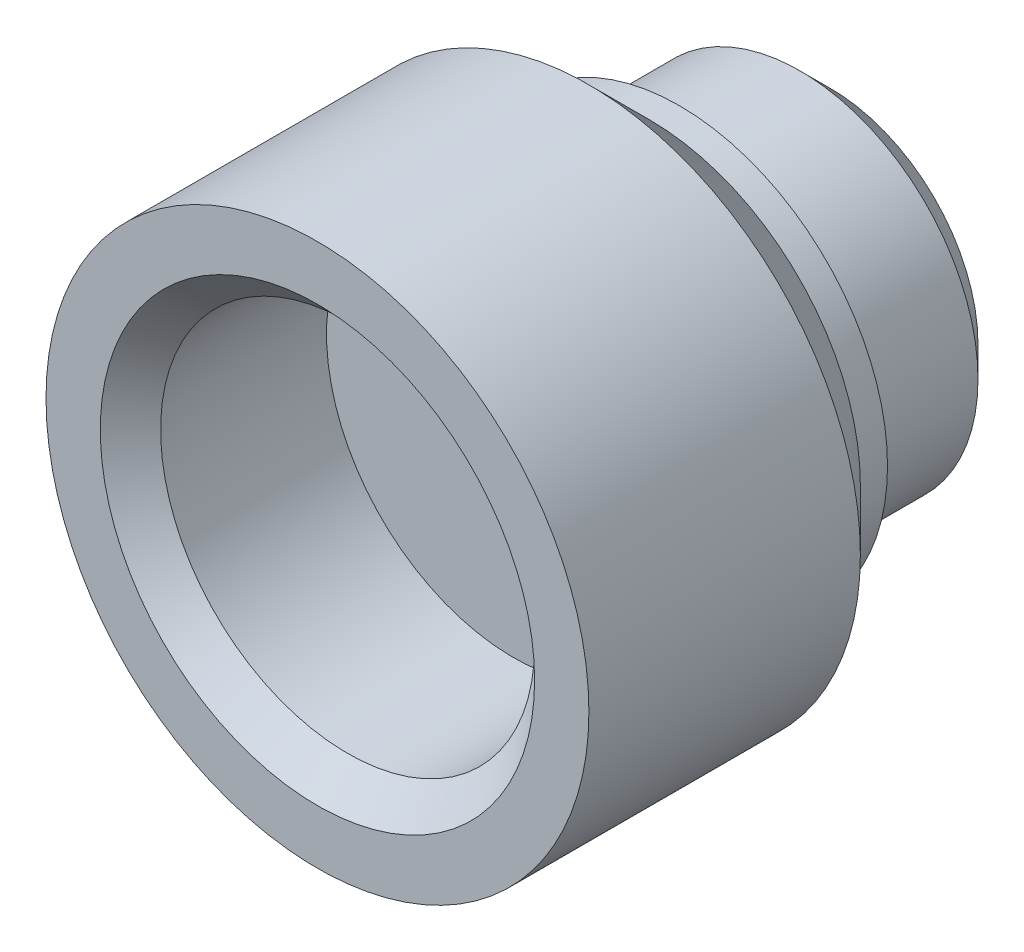
ISO-10303-21;
HEADER;
FILE_DESCRIPTION(('STEP AP214'),'2;1');
FILE_NAME('part.step','',(''),(''),'','','');
FILE_SCHEMA(('AUTOMOTIVE_DESIGN { 1 0 10303 214 1 1 1 1 }'));
ENDSEC;
DATA;
#1=APPLICATION_CONTEXT('core data for automotive mechanical design processes');
#2=APPLICATION_PROTOCOL_DEFINITION('international standard','automotive_design',2000,#1);
#3=PRODUCT_CONTEXT('',#1,'mechanical');
#4=PRODUCT('Part','Part','',(#3));
#5=PRODUCT_RELATED_PRODUCT_CATEGORY('part','',(#4));
#6=PRODUCT_DEFINITION_FORMATION('','',#4);
#7=PRODUCT_DEFINITION_CONTEXT('part definition',#1,'design');
#8=PRODUCT_DEFINITION('design','',#6,#7);
#9=PRODUCT_DEFINITION_SHAPE('','',#8);
#10=(LENGTH_UNIT() NAMED_UNIT(*) SI_UNIT(.MILLI.,.METRE.));
#11=(NAMED_UNIT(*) PLANE_ANGLE_UNIT() SI_UNIT($,.RADIAN.));
#12=(NAMED_UNIT(*) SI_UNIT($,.STERADIAN.) SOLID_ANGLE_UNIT());
#13=UNCERTAINTY_MEASURE_WITH_UNIT(LENGTH_MEASURE(1.E-05),#10,'distance_accuracy_value','');
#14=(GEOMETRIC_REPRESENTATION_CONTEXT(3) GLOBAL_UNCERTAINTY_ASSIGNED_CONTEXT((#13)) GLOBAL_UNIT_ASSIGNED_CONTEXT((#10,
#11,#12)) REPRESENTATION_CONTEXT('',''));
#15=CARTESIAN_POINT('',(0.,0.,0.));
#16=DIRECTION('',(0.,0.,1.));
#17=DIRECTION('',(1.,0.,0.));
#18=AXIS2_PLACEMENT_3D('',#15,#16,#17);
#19=CARTESIAN_POINT('',(0.,0.,3.));
#20=DIRECTION('',(0.,0.,-1.));
#21=DIRECTION('',(-1.,0.,0.));
#22=AXIS2_PLACEMENT_3D('',#19,#20,#21);
#23=CYLINDRICAL_SURFACE('',#22,1.);
#24=CARTESIAN_POINT('',(0.,0.,0.));
#25=DIRECTION('',(0.,0.,1.));
#26=DIRECTION('',(1.,0.,0.));
#27=AXIS2_PLACEMENT_3D('',#24,#25,#26);
#28=CIRCLE('',#27,1.);
#29=CARTESIAN_POINT('',(1.,0.,0.));
#30=VERTEX_POINT('',#29);
#31=EDGE_CURVE('E82',#30,#30,#28,.T.);
#32=ORIENTED_EDGE('',*,*,#31,.F.);
#33=EDGE_LOOP('',(#32));
#34=FACE_BOUND('',#33,.T.);
#35=CARTESIAN_POINT('',(0.,0.,5.25));
#36=DIRECTION('',(0.,0.,1.));
#37=DIRECTION('',(1.,0.,0.));
#38=AXIS2_PLACEMENT_3D('',#35,#36,#37);
#39=CIRCLE('',#38,1.);
#40=CARTESIAN_POINT('',(1.,0.,5.25));
#41=VERTEX_POINT('',#40);
#42=EDGE_CURVE('E83',#41,#41,#39,.T.);
#43=ORIENTED_EDGE('',*,*,#42,.T.);
#44=EDGE_LOOP('',(#43));
#45=FACE_BOUND('',#44,.T.);
#46=ADVANCED_FACE('F39',(#34,#45),#23,.F.);
#47=CARTESIAN_POINT('',(0.,0.,0.));
#48=DIRECTION('',(0.,0.,1.));
#49=DIRECTION('',(1.,0.,0.));
#50=AXIS2_PLACEMENT_3D('',#47,#48,#49);
#51=PLANE('',#50);
#52=CARTESIAN_POINT('',(0.,0.,0.));
#53=DIRECTION('',(0.,0.,1.));
#54=DIRECTION('',(1.,0.,0.));
#55=AXIS2_PLACEMENT_3D('',#52,#53,#54);
#56=CIRCLE('',#55,2.45);
#57=CARTESIAN_POINT('',(2.45,0.,0.));
#58=VERTEX_POINT('',#57);
#59=EDGE_CURVE('E58',#58,#58,#56,.F.);
#60=ORIENTED_EDGE('',*,*,#59,.T.);
#61=EDGE_LOOP('',(#60));
#62=FACE_BOUND('',#61,.T.);
#63=ORIENTED_EDGE('',*,*,#31,.T.);
#64=EDGE_LOOP('',(#63));
#65=FACE_BOUND('',#64,.T.);
#66=ADVANCED_FACE('F124',(#62,#65),#51,.F.);
#67=CARTESIAN_POINT('',(0.,0.,3.));
#68=DIRECTION('',(0.,0.,-1.));
#69=DIRECTION('',(-1.,0.,0.));
#70=AXIS2_PLACEMENT_3D('',#67,#68,#69);
#71=CYLINDRICAL_SURFACE('',#70,2.95);
#72=CARTESIAN_POINT('',(0.,0.,2.5));
#73=DIRECTION('',(0.,0.,-1.));
#74=DIRECTION('',(-1.,0.,0.));
#75=AXIS2_PLACEMENT_3D('',#72,#73,#74);
#76=CIRCLE('',#75,2.95);
#77=CARTESIAN_POINT('',(-2.95,0.,2.5));
#78=VERTEX_POINT('',#77);
#79=EDGE_CURVE('E61',#78,#78,#76,.T.);
#80=ORIENTED_EDGE('',*,*,#79,.T.);
#81=EDGE_LOOP('',(#80));
#82=FACE_BOUND('',#81,.T.);
#83=CARTESIAN_POINT('',(0.,0.,0.500000000000003));
#84=DIRECTION('',(0.,0.,1.));
#85=DIRECTION('',(1.,0.,0.));
#86=AXIS2_PLACEMENT_3D('',#83,#84,#85);
#87=CIRCLE('',#86,2.95);
#88=CARTESIAN_POINT('',(2.95,0.,0.500000000000003));
#89=VERTEX_POINT('',#88);
#90=EDGE_CURVE('E70',#89,#89,#87,.T.);
#91=ORIENTED_EDGE('',*,*,#90,.T.);
#92=EDGE_LOOP('',(#91));
#93=FACE_BOUND('',#92,.T.);
#94=ADVANCED_FACE('F120',(#82,#93),#71,.T.);
#95=CARTESIAN_POINT('',(0.,0.,8.5));
#96=DIRECTION('',(0.,0.,1.));
#97=DIRECTION('',(1.,0.,0.));
#98=AXIS2_PLACEMENT_3D('',#95,#96,#97);
#99=PLANE('',#98);
#100=CARTESIAN_POINT('',(0.,0.,8.5));
#101=DIRECTION('',(0.,0.,1.));
#102=DIRECTION('',(1.,0.,0.));
#103=AXIS2_PLACEMENT_3D('',#100,#101,#102);
#104=CIRCLE('',#103,3.60000000000001);
#105=CARTESIAN_POINT('',(3.60000000000001,0.,8.5));
#106=VERTEX_POINT('',#105);
#107=EDGE_CURVE('E74',#106,#106,#104,.F.);
#108=ORIENTED_EDGE('',*,*,#107,.T.);
#109=EDGE_LOOP('',(#108));
#110=FACE_BOUND('',#109,.T.);
#111=CARTESIAN_POINT('',(0.,0.,8.5));
#112=DIRECTION('',(0.,0.,1.));
#113=DIRECTION('',(1.,0.,0.));
#114=AXIS2_PLACEMENT_3D('',#111,#112,#113);
#115=CIRCLE('',#114,4.5);
#116=CARTESIAN_POINT('',(4.5,0.,8.5));
#117=VERTEX_POINT('',#116);
#118=EDGE_CURVE('E87',#117,#117,#115,.T.);
#119=ORIENTED_EDGE('',*,*,#118,.T.);
#120=EDGE_LOOP('',(#119));
#121=FACE_BOUND('',#120,.T.);
#122=ADVANCED_FACE('F112',(#110,#121),#99,.T.);
#123=CARTESIAN_POINT('',(0.,0.,3.));
#124=DIRECTION('',(0.,0.,1.));
#125=DIRECTION('',(1.,0.,0.));
#126=AXIS2_PLACEMENT_3D('',#123,#124,#125);
#127=PLANE('',#126);
#128=CARTESIAN_POINT('',(0.,0.,3.));
#129=DIRECTION('',(0.,0.,1.));
#130=DIRECTION('',(1.,0.,0.));
#131=AXIS2_PLACEMENT_3D('',#128,#129,#130);
#132=CIRCLE('',#131,3.5);
#133=CARTESIAN_POINT('',(3.5,0.,3.));
#134=VERTEX_POINT('',#133);
#135=EDGE_CURVE('E10',#134,#134,#132,.F.);
#136=ORIENTED_EDGE('',*,*,#135,.T.);
#137=EDGE_LOOP('',(#136));
#138=FACE_BOUND('',#137,.T.);
#139=CARTESIAN_POINT('',(0.,0.,3.));
#140=DIRECTION('',(0.,0.,1.));
#141=DIRECTION('',(1.,0.,0.));
#142=AXIS2_PLACEMENT_3D('',#139,#140,#141);
#143=CIRCLE('',#142,3.45);
#144=CARTESIAN_POINT('',(3.45,0.,3.));
#145=VERTEX_POINT('',#144);
#146=EDGE_CURVE('E53',#145,#145,#143,.F.);
#147=ORIENTED_EDGE('',*,*,#146,.F.);
#148=EDGE_LOOP('',(#147));
#149=FACE_BOUND('',#148,.T.);
#150=ADVANCED_FACE('F109',(#138,#149),#127,.F.);
#151=CARTESIAN_POINT('',(0.,0.,8.5));
#152=DIRECTION('',(0.,0.,-1.));
#153=DIRECTION('',(-1.,0.,0.));
#154=AXIS2_PLACEMENT_3D('',#151,#152,#153);
#155=CYLINDRICAL_SURFACE('',#154,4.5);
#156=CARTESIAN_POINT('',(0.,0.,4.));
#157=DIRECTION('',(0.,0.,1.));
#158=DIRECTION('',(1.,0.,0.));
#159=AXIS2_PLACEMENT_3D('',#156,#157,#158);
#160=CIRCLE('',#159,4.5);
#161=CARTESIAN_POINT('',(4.5,0.,4.));
#162=VERTEX_POINT('',#161);
#163=EDGE_CURVE('E48',#162,#162,#160,.T.);
#164=ORIENTED_EDGE('',*,*,#163,.T.);
#165=EDGE_LOOP('',(#164));
#166=FACE_BOUND('',#165,.T.);
#167=ORIENTED_EDGE('',*,*,#118,.F.);
#168=EDGE_LOOP('',(#167));
#169=FACE_BOUND('',#168,.T.);
#170=ADVANCED_FACE('F111',(#166,#169),#155,.T.);
#171=CARTESIAN_POINT('',(0.,0.,5.25));
#172=DIRECTION('',(0.,0.,1.));
#173=DIRECTION('',(1.,0.,0.));
#174=AXIS2_PLACEMENT_3D('',#171,#172,#173);
#175=CYLINDRICAL_SURFACE('',#174,3.1);
#176=CARTESIAN_POINT('',(0.,0.,8.));
#177=DIRECTION('',(0.,0.,1.));
#178=DIRECTION('',(1.,0.,0.));
#179=AXIS2_PLACEMENT_3D('',#176,#177,#178);
#180=CIRCLE('',#179,3.1);
#181=CARTESIAN_POINT('',(3.1,0.,8.));
#182=VERTEX_POINT('',#181);
#183=EDGE_CURVE('E78',#182,#182,#180,.T.);
#184=ORIENTED_EDGE('',*,*,#183,.T.);
#185=EDGE_LOOP('',(#184));
#186=FACE_BOUND('',#185,.T.);
#187=CARTESIAN_POINT('',(0.,0.,5.25));
#188=DIRECTION('',(0.,0.,1.));
#189=DIRECTION('',(1.,0.,0.));
#190=AXIS2_PLACEMENT_3D('',#187,#188,#189);
#191=CIRCLE('',#190,3.1);
#192=CARTESIAN_POINT('',(3.1,0.,5.25));
#193=VERTEX_POINT('',#192);
#194=EDGE_CURVE('E64',#193,#193,#191,.T.);
#195=ORIENTED_EDGE('',*,*,#194,.F.);
#196=EDGE_LOOP('',(#195));
#197=FACE_BOUND('',#196,.T.);
#198=ADVANCED_FACE('F118',(#186,#197),#175,.F.);
#199=CARTESIAN_POINT('',(0.,0.,5.25));
#200=DIRECTION('',(0.,0.,1.));
#201=DIRECTION('',(1.,0.,0.));
#202=AXIS2_PLACEMENT_3D('',#199,#200,#201);
#203=PLANE('',#202);
#204=ORIENTED_EDGE('',*,*,#42,.F.);
#205=EDGE_LOOP('',(#204));
#206=FACE_BOUND('',#205,.T.);
#207=ORIENTED_EDGE('',*,*,#194,.T.);
#208=EDGE_LOOP('',(#207));
#209=FACE_BOUND('',#208,.T.);
#210=ADVANCED_FACE('F145',(#206,#209),#203,.T.);
#211=CARTESIAN_POINT('',(0.,0.,8.));
#212=DIRECTION('',(0.,0.,1.));
#213=DIRECTION('',(1.,0.,0.));
#214=AXIS2_PLACEMENT_3D('',#211,#212,#213);
#215=CONICAL_SURFACE('',#214,3.1,0.785398163397451);
#216=ORIENTED_EDGE('',*,*,#107,.F.);
#217=EDGE_LOOP('',(#216));
#218=FACE_BOUND('',#217,.T.);
#219=ORIENTED_EDGE('',*,*,#183,.F.);
#220=EDGE_LOOP('',(#219));
#221=FACE_BOUND('',#220,.T.);
#222=ADVANCED_FACE('F139',(#218,#221),#215,.F.);
#223=CARTESIAN_POINT('',(0.,0.,0.500000000000003));
#224=DIRECTION('',(0.,0.,1.));
#225=DIRECTION('',(1.,0.,0.));
#226=AXIS2_PLACEMENT_3D('',#223,#224,#225);
#227=CONICAL_SURFACE('',#226,2.95,0.78539816339745);
#228=ORIENTED_EDGE('',*,*,#59,.F.);
#229=EDGE_LOOP('',(#228));
#230=FACE_BOUND('',#229,.T.);
#231=ORIENTED_EDGE('',*,*,#90,.F.);
#232=EDGE_LOOP('',(#231));
#233=FACE_BOUND('',#232,.T.);
#234=ADVANCED_FACE('F144',(#230,#233),#227,.T.);
#235=CARTESIAN_POINT('',(0.,0.,2.5));
#236=DIRECTION('',(0.,0.,-1.));
#237=DIRECTION('',(-1.,0.,0.));
#238=AXIS2_PLACEMENT_3D('',#235,#236,#237);
#239=PLANE('',#238);
#240=ORIENTED_EDGE('',*,*,#79,.F.);
#241=EDGE_LOOP('',(#240));
#242=FACE_BOUND('',#241,.T.);
#243=CARTESIAN_POINT('',(0.,0.,2.5));
#244=DIRECTION('',(0.,0.,-1.));
#245=DIRECTION('',(-1.,0.,0.));
#246=AXIS2_PLACEMENT_3D('',#243,#244,#245);
#247=CIRCLE('',#246,3.45);
#248=CARTESIAN_POINT('',(-3.45,0.,2.5));
#249=VERTEX_POINT('',#248);
#250=EDGE_CURVE('E65',#249,#249,#247,.T.);
#251=ORIENTED_EDGE('',*,*,#250,.T.);
#252=EDGE_LOOP('',(#251));
#253=FACE_BOUND('',#252,.T.);
#254=ADVANCED_FACE('F101',(#242,#253),#239,.T.);
#255=CARTESIAN_POINT('',(0.,0.,2.5));
#256=DIRECTION('',(0.,0.,1.));
#257=DIRECTION('',(1.,0.,0.));
#258=AXIS2_PLACEMENT_3D('',#255,#256,#257);
#259=CYLINDRICAL_SURFACE('',#258,3.45);
#260=ORIENTED_EDGE('',*,*,#250,.F.);
#261=EDGE_LOOP('',(#260));
#262=FACE_BOUND('',#261,.T.);
#263=ORIENTED_EDGE('',*,*,#146,.T.);
#264=EDGE_LOOP('',(#263));
#265=FACE_BOUND('',#264,.T.);
#266=ADVANCED_FACE('F103',(#262,#265),#259,.T.);
#267=CARTESIAN_POINT('',(0.,0.,4.));
#268=DIRECTION('',(0.,0.,1.));
#269=DIRECTION('',(1.,0.,0.));
#270=AXIS2_PLACEMENT_3D('',#267,#268,#269);
#271=CONICAL_SURFACE('',#270,4.5,0.78539816339745);
#272=ORIENTED_EDGE('',*,*,#135,.F.);
#273=EDGE_LOOP('',(#272));
#274=FACE_BOUND('',#273,.T.);
#275=ORIENTED_EDGE('',*,*,#163,.F.);
#276=EDGE_LOOP('',(#275));
#277=FACE_BOUND('',#276,.T.);
#278=ADVANCED_FACE('F42',(#274,#277),#271,.T.);
#279=CLOSED_SHELL('',(#46,#66,#94,#122,#150,#170,#198,#210,#222,#234,#254,#266,#278));
#280=MANIFOLD_SOLID_BREP('B2',#279);
#281=ADVANCED_BREP_SHAPE_REPRESENTATION('',(#18,#280),#14);
#282=SHAPE_DEFINITION_REPRESENTATION(#9,#281);
ENDSEC;
END-ISO-10303-21;
